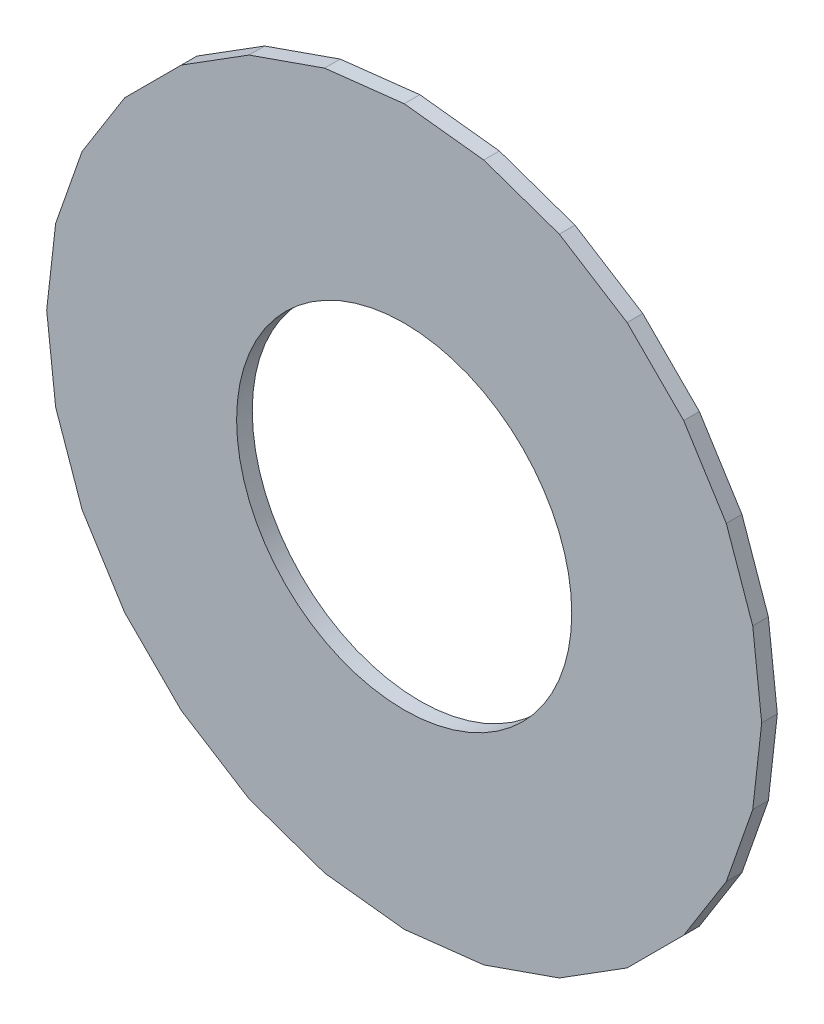
ISO-10303-21;
HEADER;
FILE_DESCRIPTION(('STEP AP214'),'2;1');
FILE_NAME('part.step','',(''),(''),'','','');
FILE_SCHEMA(('AUTOMOTIVE_DESIGN { 1 0 10303 214 1 1 1 1 }'));
ENDSEC;
DATA;
#1=APPLICATION_CONTEXT('core data for automotive mechanical design processes');
#2=APPLICATION_PROTOCOL_DEFINITION('international standard','automotive_design',2000,#1);
#3=PRODUCT_CONTEXT('',#1,'mechanical');
#4=PRODUCT('Part','Part','',(#3));
#5=PRODUCT_RELATED_PRODUCT_CATEGORY('part','',(#4));
#6=PRODUCT_DEFINITION_FORMATION('','',#4);
#7=PRODUCT_DEFINITION_CONTEXT('part definition',#1,'design');
#8=PRODUCT_DEFINITION('design','',#6,#7);
#9=PRODUCT_DEFINITION_SHAPE('','',#8);
#10=(LENGTH_UNIT() NAMED_UNIT(*) SI_UNIT(.MILLI.,.METRE.));
#11=(NAMED_UNIT(*) PLANE_ANGLE_UNIT() SI_UNIT($,.RADIAN.));
#12=(NAMED_UNIT(*) SI_UNIT($,.STERADIAN.) SOLID_ANGLE_UNIT());
#13=UNCERTAINTY_MEASURE_WITH_UNIT(LENGTH_MEASURE(1.E-05),#10,'distance_accuracy_value','');
#14=(GEOMETRIC_REPRESENTATION_CONTEXT(3) GLOBAL_UNCERTAINTY_ASSIGNED_CONTEXT((#13)) GLOBAL_UNIT_ASSIGNED_CONTEXT((#10,
#11,#12)) REPRESENTATION_CONTEXT('',''));
#15=CARTESIAN_POINT('',(0.,0.,0.));
#16=DIRECTION('',(0.,0.,1.));
#17=DIRECTION('',(1.,0.,0.));
#18=AXIS2_PLACEMENT_3D('',#15,#16,#17);
#19=CARTESIAN_POINT('',(165.608,-72.644,-0.045));
#20=DIRECTION('',(0.,0.,-1.));
#21=DIRECTION('',(0.,-1.,0.));
#22=AXIS2_PLACEMENT_3D('',#19,#20,#21);
#23=CYLINDRICAL_SURFACE('',#22,0.375);
#24=CARTESIAN_POINT('',(165.608,-72.644,1.67));
#25=DIRECTION('',(0.,0.,-1.));
#26=DIRECTION('',(0.,-1.,0.));
#27=AXIS2_PLACEMENT_3D('',#24,#25,#26);
#28=CIRCLE('',#27,0.375);
#29=CARTESIAN_POINT('',(165.608,-73.019,1.67));
#30=VERTEX_POINT('',#29);
#31=EDGE_CURVE('E553',#30,#30,#28,.T.);
#32=ORIENTED_EDGE('',*,*,#31,.T.);
#33=DIRECTION('',(0.,0.,1.));
#34=VECTOR('',#33,1.);
#35=CARTESIAN_POINT('',(165.608,-73.019,-0.045));
#36=LINE('',#35,#34);
#37=CARTESIAN_POINT('',(165.608,-73.019,1.705));
#38=VERTEX_POINT('',#37);
#39=EDGE_CURVE('E11',#30,#38,#36,.T.);
#40=ORIENTED_EDGE('',*,*,#39,.T.);
#41=CARTESIAN_POINT('',(165.608,-72.644,1.705));
#42=DIRECTION('',(0.,0.,-1.));
#43=DIRECTION('',(0.,-1.,0.));
#44=AXIS2_PLACEMENT_3D('',#41,#42,#43);
#45=CIRCLE('',#44,0.375);
#46=EDGE_CURVE('E333',#38,#38,#45,.T.);
#47=ORIENTED_EDGE('',*,*,#46,.F.);
#48=ORIENTED_EDGE('',*,*,#39,.F.);
#49=EDGE_LOOP('',(#32,#40,#47,#48));
#50=FACE_BOUND('',#49,.T.);
#51=ADVANCED_FACE('F17',(#50),#23,.F.);
#52=CARTESIAN_POINT('',(165.429983,-73.423942,1.67));
#53=DIRECTION('',(-0.330278315977918,-0.943883591336766,0.));
#54=DIRECTION('',(-0.943883591336766,0.330278315977918,0.));
#55=AXIS2_PLACEMENT_3D('',#52,#53,#54);
#56=PLANE('',#55);
#57=DIRECTION('',(0.,0.,1.));
#58=VECTOR('',#57,1.);
#59=CARTESIAN_POINT('',(165.429983,-73.423942,1.67));
#60=LINE('',#59,#58);
#61=CARTESIAN_POINT('',(165.429983,-73.423942,1.67));
#62=VERTEX_POINT('',#61);
#63=CARTESIAN_POINT('',(165.429983,-73.423942,1.705));
#64=VERTEX_POINT('',#63);
#65=EDGE_CURVE('E26',#62,#64,#60,.T.);
#66=ORIENTED_EDGE('',*,*,#65,.T.);
#67=DIRECTION('',(-0.943883591336766,0.330278315977918,0.));
#68=VECTOR('',#67,1.);
#69=CARTESIAN_POINT('',(165.429983,-73.423942,1.705));
#70=LINE('',#69,#68);
#71=CARTESIAN_POINT('',(165.260893,-73.364775,1.705));
#72=VERTEX_POINT('',#71);
#73=EDGE_CURVE('E296',#64,#72,#70,.T.);
#74=ORIENTED_EDGE('',*,*,#73,.T.);
#75=DIRECTION('',(0.,0.,1.));
#76=VECTOR('',#75,1.);
#77=CARTESIAN_POINT('',(165.260893,-73.364775,1.67));
#78=LINE('',#77,#76);
#79=CARTESIAN_POINT('',(165.260893,-73.364775,1.67));
#80=VERTEX_POINT('',#79);
#81=EDGE_CURVE('E317',#80,#72,#78,.T.);
#82=ORIENTED_EDGE('',*,*,#81,.F.);
#83=DIRECTION('',(-0.943883591336766,0.330278315977918,0.));
#84=VECTOR('',#83,1.);
#85=CARTESIAN_POINT('',(165.429983,-73.423942,1.67));
#86=LINE('',#85,#84);
#87=EDGE_CURVE('E480',#62,#80,#86,.T.);
#88=ORIENTED_EDGE('',*,*,#87,.F.);
#89=EDGE_LOOP('',(#66,#74,#82,#88));
#90=FACE_BOUND('',#89,.T.);
#91=ADVANCED_FACE('F617',(#90),#56,.T.);
#92=CARTESIAN_POINT('',(165.608,-73.444,1.67));
#93=DIRECTION('',(-0.111966136678988,-0.993712022789894,0.));
#94=DIRECTION('',(-0.993712022789894,0.111966136678988,0.));
#95=AXIS2_PLACEMENT_3D('',#92,#93,#94);
#96=PLANE('',#95);
#97=DIRECTION('',(0.,0.,1.));
#98=VECTOR('',#97,1.);
#99=CARTESIAN_POINT('',(165.608,-73.444,1.67));
#100=LINE('',#99,#98);
#101=CARTESIAN_POINT('',(165.608,-73.444,1.67));
#102=VERTEX_POINT('',#101);
#103=CARTESIAN_POINT('',(165.608,-73.444,1.705));
#104=VERTEX_POINT('',#103);
#105=EDGE_CURVE('E314',#102,#104,#100,.T.);
#106=ORIENTED_EDGE('',*,*,#105,.T.);
#107=DIRECTION('',(-0.993712022789894,0.111966136678988,0.));
#108=VECTOR('',#107,1.);
#109=CARTESIAN_POINT('',(165.608,-73.444,1.705));
#110=LINE('',#109,#108);
#111=EDGE_CURVE('E299',#104,#64,#110,.T.);
#112=ORIENTED_EDGE('',*,*,#111,.T.);
#113=ORIENTED_EDGE('',*,*,#65,.F.);
#114=DIRECTION('',(-0.993712022789894,0.111966136678988,0.));
#115=VECTOR('',#114,1.);
#116=CARTESIAN_POINT('',(165.608,-73.444,1.67));
#117=LINE('',#116,#115);
#118=EDGE_CURVE('E476',#102,#62,#117,.T.);
#119=ORIENTED_EDGE('',*,*,#118,.F.);
#120=EDGE_LOOP('',(#106,#112,#113,#119));
#121=FACE_BOUND('',#120,.T.);
#122=ADVANCED_FACE('F622',(#121),#96,.T.);
#123=CARTESIAN_POINT('',(165.260893,-73.364775,1.67));
#124=DIRECTION('',(-0.532032066600227,-0.846724205458361,0.));
#125=DIRECTION('',(-0.846724205458361,0.532032066600227,0.));
#126=AXIS2_PLACEMENT_3D('',#123,#124,#125);
#127=PLANE('',#126);
#128=ORIENTED_EDGE('',*,*,#81,.T.);
#129=DIRECTION('',(-0.846724205458361,0.532032066600227,0.));
#130=VECTOR('',#129,1.);
#131=CARTESIAN_POINT('',(165.260893,-73.364775,1.705));
#132=LINE('',#131,#130);
#133=CARTESIAN_POINT('',(165.109208,-73.269465,1.705));
#134=VERTEX_POINT('',#133);
#135=EDGE_CURVE('E295',#72,#134,#132,.T.);
#136=ORIENTED_EDGE('',*,*,#135,.T.);
#137=DIRECTION('',(0.,0.,1.));
#138=VECTOR('',#137,1.);
#139=CARTESIAN_POINT('',(165.109208,-73.269465,1.67));
#140=LINE('',#139,#138);
#141=CARTESIAN_POINT('',(165.109208,-73.269465,1.67));
#142=VERTEX_POINT('',#141);
#143=EDGE_CURVE('E318',#142,#134,#140,.T.);
#144=ORIENTED_EDGE('',*,*,#143,.F.);
#145=DIRECTION('',(-0.846724205458361,0.532032066600227,0.));
#146=VECTOR('',#145,1.);
#147=CARTESIAN_POINT('',(165.260893,-73.364775,1.67));
#148=LINE('',#147,#146);
#149=EDGE_CURVE('E512',#80,#142,#148,.T.);
#150=ORIENTED_EDGE('',*,*,#149,.F.);
#151=EDGE_LOOP('',(#128,#136,#144,#150));
#152=FACE_BOUND('',#151,.T.);
#153=ADVANCED_FACE('F394',(#152),#127,.T.);
#154=CARTESIAN_POINT('',(165.786017,-73.423942,1.67));
#155=DIRECTION('',(0.111966136678988,-0.993712022789894,0.));
#156=DIRECTION('',(0.,0.,-1.));
#157=AXIS2_PLACEMENT_3D('',#154,#155,#156);
#158=PLANE('',#157);
#159=DIRECTION('',(0.,0.,1.));
#160=VECTOR('',#159,1.);
#161=CARTESIAN_POINT('',(165.786017,-73.423942,1.67));
#162=LINE('',#161,#160);
#163=CARTESIAN_POINT('',(165.786017,-73.423942,1.67));
#164=VERTEX_POINT('',#163);
#165=CARTESIAN_POINT('',(165.786017,-73.423942,1.705));
#166=VERTEX_POINT('',#165);
#167=EDGE_CURVE('E379',#164,#166,#162,.T.);
#168=ORIENTED_EDGE('',*,*,#167,.T.);
#169=DIRECTION('',(-0.993712022789894,-0.111966136678988,0.));
#170=VECTOR('',#169,1.);
#171=CARTESIAN_POINT('',(165.786017,-73.423942,1.705));
#172=LINE('',#171,#170);
#173=EDGE_CURVE('E304',#166,#104,#172,.T.);
#174=ORIENTED_EDGE('',*,*,#173,.T.);
#175=ORIENTED_EDGE('',*,*,#105,.F.);
#176=DIRECTION('',(-0.993712022789894,-0.111966136678988,0.));
#177=VECTOR('',#176,1.);
#178=CARTESIAN_POINT('',(165.786017,-73.423942,1.67));
#179=LINE('',#178,#177);
#180=EDGE_CURVE('E481',#164,#102,#179,.T.);
#181=ORIENTED_EDGE('',*,*,#180,.F.);
#182=EDGE_LOOP('',(#168,#174,#175,#181));
#183=FACE_BOUND('',#182,.T.);
#184=ADVANCED_FACE('F678',(#183),#158,.T.);
#185=CARTESIAN_POINT('',(165.109208,-73.269465,1.67));
#186=DIRECTION('',(-0.707106781186548,-0.707106781186548,0.));
#187=DIRECTION('',(-0.707106781186548,0.707106781186548,0.));
#188=AXIS2_PLACEMENT_3D('',#185,#186,#187);
#189=PLANE('',#188);
#190=ORIENTED_EDGE('',*,*,#143,.T.);
#191=DIRECTION('',(-0.707106781186548,0.707106781186548,0.));
#192=VECTOR('',#191,1.);
#193=CARTESIAN_POINT('',(165.109208,-73.269465,1.705));
#194=LINE('',#193,#192);
#195=CARTESIAN_POINT('',(164.982535,-73.142792,1.705));
#196=VERTEX_POINT('',#195);
#197=EDGE_CURVE('E277',#134,#196,#194,.T.);
#198=ORIENTED_EDGE('',*,*,#197,.T.);
#199=DIRECTION('',(0.,0.,1.));
#200=VECTOR('',#199,1.);
#201=CARTESIAN_POINT('',(164.982535,-73.142792,1.67));
#202=LINE('',#201,#200);
#203=CARTESIAN_POINT('',(164.982535,-73.142792,1.67));
#204=VERTEX_POINT('',#203);
#205=EDGE_CURVE('E272',#204,#196,#202,.T.);
#206=ORIENTED_EDGE('',*,*,#205,.F.);
#207=DIRECTION('',(-0.707106781186548,0.707106781186548,0.));
#208=VECTOR('',#207,1.);
#209=CARTESIAN_POINT('',(165.109208,-73.269465,1.67));
#210=LINE('',#209,#208);
#211=EDGE_CURVE('E389',#142,#204,#210,.T.);
#212=ORIENTED_EDGE('',*,*,#211,.F.);
#213=EDGE_LOOP('',(#190,#198,#206,#212));
#214=FACE_BOUND('',#213,.T.);
#215=ADVANCED_FACE('F387',(#214),#189,.T.);
#216=CARTESIAN_POINT('',(165.955107,-73.364775,1.67));
#217=DIRECTION('',(0.330278315977027,-0.943883591337077,0.));
#218=DIRECTION('',(0.,0.,-1.));
#219=AXIS2_PLACEMENT_3D('',#216,#217,#218);
#220=PLANE('',#219);
#221=DIRECTION('',(0.,0.,1.));
#222=VECTOR('',#221,1.);
#223=CARTESIAN_POINT('',(165.955107,-73.364775,1.67));
#224=LINE('',#223,#222);
#225=CARTESIAN_POINT('',(165.955107,-73.364775,1.67));
#226=VERTEX_POINT('',#225);
#227=CARTESIAN_POINT('',(165.955107,-73.364775,1.705));
#228=VERTEX_POINT('',#227);
#229=EDGE_CURVE('E266',#226,#228,#224,.T.);
#230=ORIENTED_EDGE('',*,*,#229,.T.);
#231=DIRECTION('',(-0.943883591337077,-0.330278315977027,0.));
#232=VECTOR('',#231,1.);
#233=CARTESIAN_POINT('',(165.955107,-73.364775,1.705));
#234=LINE('',#233,#232);
#235=EDGE_CURVE('E313',#228,#166,#234,.T.);
#236=ORIENTED_EDGE('',*,*,#235,.T.);
#237=ORIENTED_EDGE('',*,*,#167,.F.);
#238=DIRECTION('',(-0.943883591337077,-0.330278315977027,0.));
#239=VECTOR('',#238,1.);
#240=CARTESIAN_POINT('',(165.955107,-73.364775,1.67));
#241=LINE('',#240,#239);
#242=EDGE_CURVE('E495',#226,#164,#241,.T.);
#243=ORIENTED_EDGE('',*,*,#242,.F.);
#244=EDGE_LOOP('',(#230,#236,#237,#243));
#245=FACE_BOUND('',#244,.T.);
#246=ADVANCED_FACE('F677',(#245),#220,.T.);
#247=CARTESIAN_POINT('',(164.982535,-73.142792,1.67));
#248=DIRECTION('',(-0.846724205458361,-0.532032066600227,0.));
#249=DIRECTION('',(-0.532032066600227,0.846724205458361,0.));
#250=AXIS2_PLACEMENT_3D('',#247,#248,#249);
#251=PLANE('',#250);
#252=ORIENTED_EDGE('',*,*,#205,.T.);
#253=DIRECTION('',(-0.532032066600227,0.846724205458361,0.));
#254=VECTOR('',#253,1.);
#255=CARTESIAN_POINT('',(164.982535,-73.142792,1.705));
#256=LINE('',#255,#254);
#257=CARTESIAN_POINT('',(164.887225,-72.991107,1.705));
#258=VERTEX_POINT('',#257);
#259=EDGE_CURVE('E270',#196,#258,#256,.T.);
#260=ORIENTED_EDGE('',*,*,#259,.T.);
#261=DIRECTION('',(0.,0.,1.));
#262=VECTOR('',#261,1.);
#263=CARTESIAN_POINT('',(164.887225,-72.991107,1.67));
#264=LINE('',#263,#262);
#265=CARTESIAN_POINT('',(164.887225,-72.991107,1.67));
#266=VERTEX_POINT('',#265);
#267=EDGE_CURVE('E254',#266,#258,#264,.T.);
#268=ORIENTED_EDGE('',*,*,#267,.F.);
#269=DIRECTION('',(-0.532032066600227,0.846724205458361,0.));
#270=VECTOR('',#269,1.);
#271=CARTESIAN_POINT('',(164.982535,-73.142792,1.67));
#272=LINE('',#271,#270);
#273=EDGE_CURVE('E527',#204,#266,#272,.T.);
#274=ORIENTED_EDGE('',*,*,#273,.F.);
#275=EDGE_LOOP('',(#252,#260,#268,#274));
#276=FACE_BOUND('',#275,.T.);
#277=ADVANCED_FACE('F271',(#276),#251,.T.);
#278=CARTESIAN_POINT('',(166.106792,-73.269465,1.67));
#279=DIRECTION('',(0.532032066600227,-0.846724205458361,0.));
#280=DIRECTION('',(0.,0.,-1.));
#281=AXIS2_PLACEMENT_3D('',#278,#279,#280);
#282=PLANE('',#281);
#283=DIRECTION('',(0.,0.,1.));
#284=VECTOR('',#283,1.);
#285=CARTESIAN_POINT('',(166.106792,-73.269465,1.67));
#286=LINE('',#285,#284);
#287=CARTESIAN_POINT('',(166.106792,-73.269465,1.67));
#288=VERTEX_POINT('',#287);
#289=CARTESIAN_POINT('',(166.106792,-73.269465,1.705));
#290=VERTEX_POINT('',#289);
#291=EDGE_CURVE('E267',#288,#290,#286,.T.);
#292=ORIENTED_EDGE('',*,*,#291,.T.);
#293=DIRECTION('',(-0.846724205458361,-0.532032066600227,0.));
#294=VECTOR('',#293,1.);
#295=CARTESIAN_POINT('',(166.106792,-73.269465,1.705));
#296=LINE('',#295,#294);
#297=EDGE_CURVE('E322',#290,#228,#296,.T.);
#298=ORIENTED_EDGE('',*,*,#297,.T.);
#299=ORIENTED_EDGE('',*,*,#229,.F.);
#300=DIRECTION('',(-0.846724205458361,-0.532032066600227,0.));
#301=VECTOR('',#300,1.);
#302=CARTESIAN_POINT('',(166.106792,-73.269465,1.67));
#303=LINE('',#302,#301);
#304=EDGE_CURVE('E499',#288,#226,#303,.T.);
#305=ORIENTED_EDGE('',*,*,#304,.F.);
#306=EDGE_LOOP('',(#292,#298,#299,#305));
#307=FACE_BOUND('',#306,.T.);
#308=ADVANCED_FACE('F749',(#307),#282,.T.);
#309=CARTESIAN_POINT('',(164.887225,-72.991107,1.67));
#310=DIRECTION('',(-0.943883591337077,-0.330278315977027,0.));
#311=DIRECTION('',(-0.330278315977027,0.943883591337077,0.));
#312=AXIS2_PLACEMENT_3D('',#309,#310,#311);
#313=PLANE('',#312);
#314=ORIENTED_EDGE('',*,*,#267,.T.);
#315=DIRECTION('',(-0.330278315977027,0.943883591337077,0.));
#316=VECTOR('',#315,1.);
#317=CARTESIAN_POINT('',(164.887225,-72.991107,1.705));
#318=LINE('',#317,#316);
#319=CARTESIAN_POINT('',(164.828058,-72.822017,1.705));
#320=VERTEX_POINT('',#319);
#321=EDGE_CURVE('E258',#258,#320,#318,.T.);
#322=ORIENTED_EDGE('',*,*,#321,.T.);
#323=DIRECTION('',(0.,0.,1.));
#324=VECTOR('',#323,1.);
#325=CARTESIAN_POINT('',(164.828058,-72.822017,1.67));
#326=LINE('',#325,#324);
#327=CARTESIAN_POINT('',(164.828058,-72.822017,1.67));
#328=VERTEX_POINT('',#327);
#329=EDGE_CURVE('E248',#328,#320,#326,.T.);
#330=ORIENTED_EDGE('',*,*,#329,.F.);
#331=DIRECTION('',(-0.330278315977027,0.943883591337077,0.));
#332=VECTOR('',#331,1.);
#333=CARTESIAN_POINT('',(164.887225,-72.991107,1.67));
#334=LINE('',#333,#332);
#335=EDGE_CURVE('E261',#266,#328,#334,.T.);
#336=ORIENTED_EDGE('',*,*,#335,.F.);
#337=EDGE_LOOP('',(#314,#322,#330,#336));
#338=FACE_BOUND('',#337,.T.);
#339=ADVANCED_FACE('F256',(#338),#313,.T.);
#340=CARTESIAN_POINT('',(166.233465,-73.142792,1.67));
#341=DIRECTION('',(0.707106781186548,-0.707106781186548,0.));
#342=DIRECTION('',(0.,0.,-1.));
#343=AXIS2_PLACEMENT_3D('',#340,#341,#342);
#344=PLANE('',#343);
#345=DIRECTION('',(0.,0.,1.));
#346=VECTOR('',#345,1.);
#347=CARTESIAN_POINT('',(166.233465,-73.142792,1.67));
#348=LINE('',#347,#346);
#349=CARTESIAN_POINT('',(166.233465,-73.142792,1.67));
#350=VERTEX_POINT('',#349);
#351=CARTESIAN_POINT('',(166.233465,-73.142792,1.705));
#352=VERTEX_POINT('',#351);
#353=EDGE_CURVE('E513',#350,#352,#348,.T.);
#354=ORIENTED_EDGE('',*,*,#353,.T.);
#355=DIRECTION('',(-0.707106781186548,-0.707106781186548,0.));
#356=VECTOR('',#355,1.);
#357=CARTESIAN_POINT('',(166.233465,-73.142792,1.705));
#358=LINE('',#357,#356);
#359=EDGE_CURVE('E328',#352,#290,#358,.T.);
#360=ORIENTED_EDGE('',*,*,#359,.T.);
#361=ORIENTED_EDGE('',*,*,#291,.F.);
#362=DIRECTION('',(-0.707106781186548,-0.707106781186548,0.));
#363=VECTOR('',#362,1.);
#364=CARTESIAN_POINT('',(166.233465,-73.142792,1.67));
#365=LINE('',#364,#363);
#366=EDGE_CURVE('E494',#350,#288,#365,.T.);
#367=ORIENTED_EDGE('',*,*,#366,.F.);
#368=EDGE_LOOP('',(#354,#360,#361,#367));
#369=FACE_BOUND('',#368,.T.);
#370=ADVANCED_FACE('F603',(#369),#344,.T.);
#371=CARTESIAN_POINT('',(164.828058,-72.822017,1.67));
#372=DIRECTION('',(-0.993712022789894,-0.111966136678988,0.));
#373=DIRECTION('',(-0.111966136678988,0.993712022789894,0.));
#374=AXIS2_PLACEMENT_3D('',#371,#372,#373);
#375=PLANE('',#374);
#376=ORIENTED_EDGE('',*,*,#329,.T.);
#377=DIRECTION('',(-0.111966136678988,0.993712022789894,0.));
#378=VECTOR('',#377,1.);
#379=CARTESIAN_POINT('',(164.828058,-72.822017,1.705));
#380=LINE('',#379,#378);
#381=CARTESIAN_POINT('',(164.808,-72.644,1.705));
#382=VERTEX_POINT('',#381);
#383=EDGE_CURVE('E282',#320,#382,#380,.T.);
#384=ORIENTED_EDGE('',*,*,#383,.T.);
#385=DIRECTION('',(0.,0.,1.));
#386=VECTOR('',#385,1.);
#387=CARTESIAN_POINT('',(164.808,-72.644,1.67));
#388=LINE('',#387,#386);
#389=CARTESIAN_POINT('',(164.808,-72.644,1.67));
#390=VERTEX_POINT('',#389);
#391=EDGE_CURVE('E374',#390,#382,#388,.T.);
#392=ORIENTED_EDGE('',*,*,#391,.F.);
#393=DIRECTION('',(-0.111966136678988,0.993712022789894,0.));
#394=VECTOR('',#393,1.);
#395=CARTESIAN_POINT('',(164.828058,-72.822017,1.67));
#396=LINE('',#395,#394);
#397=EDGE_CURVE('E448',#328,#390,#396,.T.);
#398=ORIENTED_EDGE('',*,*,#397,.F.);
#399=EDGE_LOOP('',(#376,#384,#392,#398));
#400=FACE_BOUND('',#399,.T.);
#401=ADVANCED_FACE('F600',(#400),#375,.T.);
#402=CARTESIAN_POINT('',(166.328775,-72.991107,1.67));
#403=DIRECTION('',(0.846724205458361,-0.532032066600227,0.));
#404=DIRECTION('',(0.,0.,-1.));
#405=AXIS2_PLACEMENT_3D('',#402,#403,#404);
#406=PLANE('',#405);
#407=DIRECTION('',(0.,0.,1.));
#408=VECTOR('',#407,1.);
#409=CARTESIAN_POINT('',(166.328775,-72.991107,1.67));
#410=LINE('',#409,#408);
#411=CARTESIAN_POINT('',(166.328775,-72.991107,1.67));
#412=VERTEX_POINT('',#411);
#413=CARTESIAN_POINT('',(166.328775,-72.991107,1.705));
#414=VERTEX_POINT('',#413);
#415=EDGE_CURVE('E371',#412,#414,#410,.T.);
#416=ORIENTED_EDGE('',*,*,#415,.T.);
#417=DIRECTION('',(-0.532032066600227,-0.846724205458361,0.));
#418=VECTOR('',#417,1.);
#419=CARTESIAN_POINT('',(166.328775,-72.991107,1.705));
#420=LINE('',#419,#418);
#421=EDGE_CURVE('E332',#414,#352,#420,.T.);
#422=ORIENTED_EDGE('',*,*,#421,.T.);
#423=ORIENTED_EDGE('',*,*,#353,.F.);
#424=DIRECTION('',(-0.532032066600227,-0.846724205458361,0.));
#425=VECTOR('',#424,1.);
#426=CARTESIAN_POINT('',(166.328775,-72.991107,1.67));
#427=LINE('',#426,#425);
#428=EDGE_CURVE('E462',#412,#350,#427,.T.);
#429=ORIENTED_EDGE('',*,*,#428,.F.);
#430=EDGE_LOOP('',(#416,#422,#423,#429));
#431=FACE_BOUND('',#430,.T.);
#432=ADVANCED_FACE('F602',(#431),#406,.T.);
#433=CARTESIAN_POINT('',(164.808,-72.644,1.67));
#434=DIRECTION('',(-0.993712022789894,0.111966136678988,0.));
#435=DIRECTION('',(0.,0.,1.));
#436=AXIS2_PLACEMENT_3D('',#433,#434,#435);
#437=PLANE('',#436);
#438=ORIENTED_EDGE('',*,*,#391,.T.);
#439=DIRECTION('',(0.111966136678988,0.993712022789894,0.));
#440=VECTOR('',#439,1.);
#441=CARTESIAN_POINT('',(164.808,-72.644,1.705));
#442=LINE('',#441,#440);
#443=CARTESIAN_POINT('',(164.828058,-72.465983,1.705));
#444=VERTEX_POINT('',#443);
#445=EDGE_CURVE('E289',#382,#444,#442,.T.);
#446=ORIENTED_EDGE('',*,*,#445,.T.);
#447=DIRECTION('',(0.,0.,1.));
#448=VECTOR('',#447,1.);
#449=CARTESIAN_POINT('',(164.828058,-72.465983,1.67));
#450=LINE('',#449,#448);
#451=CARTESIAN_POINT('',(164.828058,-72.465983,1.67));
#452=VERTEX_POINT('',#451);
#453=EDGE_CURVE('E368',#452,#444,#450,.T.);
#454=ORIENTED_EDGE('',*,*,#453,.F.);
#455=DIRECTION('',(0.111966136678988,0.993712022789894,0.));
#456=VECTOR('',#455,1.);
#457=CARTESIAN_POINT('',(164.808,-72.644,1.67));
#458=LINE('',#457,#456);
#459=EDGE_CURVE('E452',#390,#452,#458,.T.);
#460=ORIENTED_EDGE('',*,*,#459,.F.);
#461=EDGE_LOOP('',(#438,#446,#454,#460));
#462=FACE_BOUND('',#461,.T.);
#463=ADVANCED_FACE('F590',(#462),#437,.T.);
#464=CARTESIAN_POINT('',(166.387942,-72.822017,1.67));
#465=DIRECTION('',(0.943883591337077,-0.330278315977027,0.));
#466=DIRECTION('',(0.,0.,-1.));
#467=AXIS2_PLACEMENT_3D('',#464,#465,#466);
#468=PLANE('',#467);
#469=DIRECTION('',(0.,0.,1.));
#470=VECTOR('',#469,1.);
#471=CARTESIAN_POINT('',(166.387942,-72.822017,1.67));
#472=LINE('',#471,#470);
#473=CARTESIAN_POINT('',(166.387942,-72.822017,1.67));
#474=VERTEX_POINT('',#473);
#475=CARTESIAN_POINT('',(166.387942,-72.822017,1.705));
#476=VERTEX_POINT('',#475);
#477=EDGE_CURVE('E367',#474,#476,#472,.T.);
#478=ORIENTED_EDGE('',*,*,#477,.T.);
#479=DIRECTION('',(-0.330278315977027,-0.943883591337077,0.));
#480=VECTOR('',#479,1.);
#481=CARTESIAN_POINT('',(166.387942,-72.822017,1.705));
#482=LINE('',#481,#480);
#483=EDGE_CURVE('E341',#476,#414,#482,.T.);
#484=ORIENTED_EDGE('',*,*,#483,.T.);
#485=ORIENTED_EDGE('',*,*,#415,.F.);
#486=DIRECTION('',(-0.330278315977027,-0.943883591337077,0.));
#487=VECTOR('',#486,1.);
#488=CARTESIAN_POINT('',(166.387942,-72.822017,1.67));
#489=LINE('',#488,#487);
#490=EDGE_CURVE('E458',#474,#412,#489,.T.);
#491=ORIENTED_EDGE('',*,*,#490,.F.);
#492=EDGE_LOOP('',(#478,#484,#485,#491));
#493=FACE_BOUND('',#492,.T.);
#494=ADVANCED_FACE('F645',(#493),#468,.T.);
#495=CARTESIAN_POINT('',(164.828058,-72.465983,1.67));
#496=DIRECTION('',(-0.943883591337077,0.330278315977027,0.));
#497=DIRECTION('',(0.,0.,1.));
#498=AXIS2_PLACEMENT_3D('',#495,#496,#497);
#499=PLANE('',#498);
#500=ORIENTED_EDGE('',*,*,#453,.T.);
#501=DIRECTION('',(0.330278315977027,0.943883591337077,0.));
#502=VECTOR('',#501,1.);
#503=CARTESIAN_POINT('',(164.828058,-72.465983,1.705));
#504=LINE('',#503,#502);
#505=CARTESIAN_POINT('',(164.887225,-72.296893,1.705));
#506=VERTEX_POINT('',#505);
#507=EDGE_CURVE('E581',#444,#506,#504,.T.);
#508=ORIENTED_EDGE('',*,*,#507,.T.);
#509=DIRECTION('',(0.,0.,1.));
#510=VECTOR('',#509,1.);
#511=CARTESIAN_POINT('',(164.887225,-72.296893,1.67));
#512=LINE('',#511,#510);
#513=CARTESIAN_POINT('',(164.887225,-72.296893,1.67));
#514=VERTEX_POINT('',#513);
#515=EDGE_CURVE('E326',#514,#506,#512,.T.);
#516=ORIENTED_EDGE('',*,*,#515,.F.);
#517=DIRECTION('',(0.330278315977027,0.943883591337077,0.));
#518=VECTOR('',#517,1.);
#519=CARTESIAN_POINT('',(164.828058,-72.465983,1.67));
#520=LINE('',#519,#518);
#521=EDGE_CURVE('E408',#452,#514,#520,.T.);
#522=ORIENTED_EDGE('',*,*,#521,.F.);
#523=EDGE_LOOP('',(#500,#508,#516,#522));
#524=FACE_BOUND('',#523,.T.);
#525=ADVANCED_FACE('F596',(#524),#499,.T.);
#526=CARTESIAN_POINT('',(166.408,-72.644,1.67));
#527=DIRECTION('',(0.993712022789894,-0.111966136678988,0.));
#528=DIRECTION('',(0.,0.,-1.));
#529=AXIS2_PLACEMENT_3D('',#526,#527,#528);
#530=PLANE('',#529);
#531=DIRECTION('',(0.,0.,1.));
#532=VECTOR('',#531,1.);
#533=CARTESIAN_POINT('',(166.408,-72.644,1.67));
#534=LINE('',#533,#532);
#535=CARTESIAN_POINT('',(166.408,-72.644,1.67));
#536=VERTEX_POINT('',#535);
#537=CARTESIAN_POINT('',(166.408,-72.644,1.705));
#538=VERTEX_POINT('',#537);
#539=EDGE_CURVE('E323',#536,#538,#534,.T.);
#540=ORIENTED_EDGE('',*,*,#539,.T.);
#541=DIRECTION('',(-0.111966136678988,-0.993712022789894,0.));
#542=VECTOR('',#541,1.);
#543=CARTESIAN_POINT('',(166.408,-72.644,1.705));
#544=LINE('',#543,#542);
#545=EDGE_CURVE('E309',#538,#476,#544,.T.);
#546=ORIENTED_EDGE('',*,*,#545,.T.);
#547=ORIENTED_EDGE('',*,*,#477,.F.);
#548=DIRECTION('',(-0.111966136678988,-0.993712022789894,0.));
#549=VECTOR('',#548,1.);
#550=CARTESIAN_POINT('',(166.408,-72.644,1.67));
#551=LINE('',#550,#549);
#552=EDGE_CURVE('E463',#536,#474,#551,.T.);
#553=ORIENTED_EDGE('',*,*,#552,.F.);
#554=EDGE_LOOP('',(#540,#546,#547,#553));
#555=FACE_BOUND('',#554,.T.);
#556=ADVANCED_FACE('F684',(#555),#530,.T.);
#557=CARTESIAN_POINT('',(164.887225,-72.296893,1.67));
#558=DIRECTION('',(-0.846724205458361,0.532032066600227,0.));
#559=DIRECTION('',(0.,0.,1.));
#560=AXIS2_PLACEMENT_3D('',#557,#558,#559);
#561=PLANE('',#560);
#562=ORIENTED_EDGE('',*,*,#515,.T.);
#563=DIRECTION('',(0.532032066600227,0.846724205458361,0.));
#564=VECTOR('',#563,1.);
#565=CARTESIAN_POINT('',(164.887225,-72.296893,1.705));
#566=LINE('',#565,#564);
#567=CARTESIAN_POINT('',(164.982535,-72.145208,1.705));
#568=VERTEX_POINT('',#567);
#569=EDGE_CURVE('E577',#506,#568,#566,.T.);
#570=ORIENTED_EDGE('',*,*,#569,.T.);
#571=DIRECTION('',(0.,0.,1.));
#572=VECTOR('',#571,1.);
#573=CARTESIAN_POINT('',(164.982535,-72.145208,1.67));
#574=LINE('',#573,#572);
#575=CARTESIAN_POINT('',(164.982535,-72.145208,1.67));
#576=VERTEX_POINT('',#575);
#577=EDGE_CURVE('E327',#576,#568,#574,.T.);
#578=ORIENTED_EDGE('',*,*,#577,.F.);
#579=DIRECTION('',(0.532032066600227,0.846724205458361,0.));
#580=VECTOR('',#579,1.);
#581=CARTESIAN_POINT('',(164.887225,-72.296893,1.67));
#582=LINE('',#581,#580);
#583=EDGE_CURVE('E403',#514,#576,#582,.T.);
#584=ORIENTED_EDGE('',*,*,#583,.F.);
#585=EDGE_LOOP('',(#562,#570,#578,#584));
#586=FACE_BOUND('',#585,.T.);
#587=ADVANCED_FACE('F687',(#586),#561,.T.);
#588=CARTESIAN_POINT('',(166.387942,-72.465983,1.67));
#589=DIRECTION('',(0.993712022789894,0.111966136678988,0.));
#590=DIRECTION('',(0.,0.,-1.));
#591=AXIS2_PLACEMENT_3D('',#588,#589,#590);
#592=PLANE('',#591);
#593=DIRECTION('',(0.,0.,1.));
#594=VECTOR('',#593,1.);
#595=CARTESIAN_POINT('',(166.387942,-72.465983,1.67));
#596=LINE('',#595,#594);
#597=CARTESIAN_POINT('',(166.387942,-72.465983,1.67));
#598=VERTEX_POINT('',#597);
#599=CARTESIAN_POINT('',(166.387942,-72.465983,1.705));
#600=VERTEX_POINT('',#599);
#601=EDGE_CURVE('E111',#598,#600,#596,.T.);
#602=ORIENTED_EDGE('',*,*,#601,.T.);
#603=DIRECTION('',(0.111966136678988,-0.993712022789894,0.));
#604=VECTOR('',#603,1.);
#605=CARTESIAN_POINT('',(166.387942,-72.465983,1.705));
#606=LINE('',#605,#604);
#607=EDGE_CURVE('E305',#600,#538,#606,.T.);
#608=ORIENTED_EDGE('',*,*,#607,.T.);
#609=ORIENTED_EDGE('',*,*,#539,.F.);
#610=DIRECTION('',(0.111966136678988,-0.993712022789894,0.));
#611=VECTOR('',#610,1.);
#612=CARTESIAN_POINT('',(166.387942,-72.465983,1.67));
#613=LINE('',#612,#611);
#614=EDGE_CURVE('E424',#598,#536,#613,.T.);
#615=ORIENTED_EDGE('',*,*,#614,.F.);
#616=EDGE_LOOP('',(#602,#608,#609,#615));
#617=FACE_BOUND('',#616,.T.);
#618=ADVANCED_FACE('F654',(#617),#592,.T.);
#619=CARTESIAN_POINT('',(164.982535,-72.145208,1.67));
#620=DIRECTION('',(-0.707106781186548,0.707106781186548,0.));
#621=DIRECTION('',(0.,0.,1.));
#622=AXIS2_PLACEMENT_3D('',#619,#620,#621);
#623=PLANE('',#622);
#624=ORIENTED_EDGE('',*,*,#577,.T.);
#625=DIRECTION('',(0.707106781186548,0.707106781186548,0.));
#626=VECTOR('',#625,1.);
#627=CARTESIAN_POINT('',(164.982535,-72.145208,1.705));
#628=LINE('',#627,#626);
#629=CARTESIAN_POINT('',(165.109208,-72.018535,1.705));
#630=VERTEX_POINT('',#629);
#631=EDGE_CURVE('E570',#568,#630,#628,.T.);
#632=ORIENTED_EDGE('',*,*,#631,.T.);
#633=DIRECTION('',(0.,0.,1.));
#634=VECTOR('',#633,1.);
#635=CARTESIAN_POINT('',(165.109208,-72.018535,1.67));
#636=LINE('',#635,#634);
#637=CARTESIAN_POINT('',(165.109208,-72.018535,1.67));
#638=VERTEX_POINT('',#637);
#639=EDGE_CURVE('E356',#638,#630,#636,.T.);
#640=ORIENTED_EDGE('',*,*,#639,.F.);
#641=DIRECTION('',(0.707106781186548,0.707106781186548,0.));
#642=VECTOR('',#641,1.);
#643=CARTESIAN_POINT('',(164.982535,-72.145208,1.67));
#644=LINE('',#643,#642);
#645=EDGE_CURVE('E407',#576,#638,#644,.T.);
#646=ORIENTED_EDGE('',*,*,#645,.F.);
#647=EDGE_LOOP('',(#624,#632,#640,#646));
#648=FACE_BOUND('',#647,.T.);
#649=ADVANCED_FACE('F650',(#648),#623,.T.);
#650=CARTESIAN_POINT('',(166.328775,-72.296893,1.67));
#651=DIRECTION('',(0.943883591337077,0.330278315977027,0.));
#652=DIRECTION('',(0.,0.,-1.));
#653=AXIS2_PLACEMENT_3D('',#650,#651,#652);
#654=PLANE('',#653);
#655=DIRECTION('',(0.,0.,1.));
#656=VECTOR('',#655,1.);
#657=CARTESIAN_POINT('',(166.328775,-72.296893,1.67));
#658=LINE('',#657,#656);
#659=CARTESIAN_POINT('',(166.328775,-72.296893,1.67));
#660=VERTEX_POINT('',#659);
#661=CARTESIAN_POINT('',(166.328775,-72.296893,1.705));
#662=VERTEX_POINT('',#661);
#663=EDGE_CURVE('E99',#660,#662,#658,.T.);
#664=ORIENTED_EDGE('',*,*,#663,.T.);
#665=DIRECTION('',(0.330278315977027,-0.943883591337077,0.));
#666=VECTOR('',#665,1.);
#667=CARTESIAN_POINT('',(166.328775,-72.296893,1.705));
#668=LINE('',#667,#666);
#669=EDGE_CURVE('E308',#662,#600,#668,.T.);
#670=ORIENTED_EDGE('',*,*,#669,.T.);
#671=ORIENTED_EDGE('',*,*,#601,.F.);
#672=DIRECTION('',(0.330278315977027,-0.943883591337077,0.));
#673=VECTOR('',#672,1.);
#674=CARTESIAN_POINT('',(166.328775,-72.296893,1.67));
#675=LINE('',#674,#673);
#676=EDGE_CURVE('E420',#660,#598,#675,.T.);
#677=ORIENTED_EDGE('',*,*,#676,.F.);
#678=EDGE_LOOP('',(#664,#670,#671,#677));
#679=FACE_BOUND('',#678,.T.);
#680=ADVANCED_FACE('F653',(#679),#654,.T.);
#681=CARTESIAN_POINT('',(165.109208,-72.018535,1.67));
#682=DIRECTION('',(-0.532032066600227,0.846724205458361,0.));
#683=DIRECTION('',(0.,0.,1.));
#684=AXIS2_PLACEMENT_3D('',#681,#682,#683);
#685=PLANE('',#684);
#686=ORIENTED_EDGE('',*,*,#639,.T.);
#687=DIRECTION('',(0.846724205458361,0.532032066600227,0.));
#688=VECTOR('',#687,1.);
#689=CARTESIAN_POINT('',(165.109208,-72.018535,1.705));
#690=LINE('',#689,#688);
#691=CARTESIAN_POINT('',(165.260893,-71.923225,1.705));
#692=VERTEX_POINT('',#691);
#693=EDGE_CURVE('E566',#630,#692,#690,.T.);
#694=ORIENTED_EDGE('',*,*,#693,.T.);
#695=DIRECTION('',(0.,0.,1.));
#696=VECTOR('',#695,1.);
#697=CARTESIAN_POINT('',(165.260893,-71.923225,1.67));
#698=LINE('',#697,#696);
#699=CARTESIAN_POINT('',(165.260893,-71.923225,1.67));
#700=VERTEX_POINT('',#699);
#701=EDGE_CURVE('E351',#700,#692,#698,.T.);
#702=ORIENTED_EDGE('',*,*,#701,.F.);
#703=DIRECTION('',(0.846724205458361,0.532032066600227,0.));
#704=VECTOR('',#703,1.);
#705=CARTESIAN_POINT('',(165.109208,-72.018535,1.67));
#706=LINE('',#705,#704);
#707=EDGE_CURVE('E524',#638,#700,#706,.T.);
#708=ORIENTED_EDGE('',*,*,#707,.F.);
#709=EDGE_LOOP('',(#686,#694,#702,#708));
#710=FACE_BOUND('',#709,.T.);
#711=ADVANCED_FACE('F667',(#710),#685,.T.);
#712=CARTESIAN_POINT('',(166.233465,-72.145208,1.67));
#713=DIRECTION('',(0.846724205458361,0.532032066600227,0.));
#714=DIRECTION('',(0.,0.,-1.));
#715=AXIS2_PLACEMENT_3D('',#712,#713,#714);
#716=PLANE('',#715);
#717=DIRECTION('',(0.,0.,1.));
#718=VECTOR('',#717,1.);
#719=CARTESIAN_POINT('',(166.233465,-72.145208,1.67));
#720=LINE('',#719,#718);
#721=CARTESIAN_POINT('',(166.233465,-72.145208,1.67));
#722=VERTEX_POINT('',#721);
#723=CARTESIAN_POINT('',(166.233465,-72.145208,1.705));
#724=VERTEX_POINT('',#723);
#725=EDGE_CURVE('E350',#722,#724,#720,.T.);
#726=ORIENTED_EDGE('',*,*,#725,.T.);
#727=DIRECTION('',(0.532032066600227,-0.846724205458361,0.));
#728=VECTOR('',#727,1.);
#729=CARTESIAN_POINT('',(166.233465,-72.145208,1.705));
#730=LINE('',#729,#728);
#731=EDGE_CURVE('E342',#724,#662,#730,.T.);
#732=ORIENTED_EDGE('',*,*,#731,.T.);
#733=ORIENTED_EDGE('',*,*,#663,.F.);
#734=DIRECTION('',(0.532032066600227,-0.846724205458361,0.));
#735=VECTOR('',#734,1.);
#736=CARTESIAN_POINT('',(166.233465,-72.145208,1.67));
#737=LINE('',#736,#735);
#738=EDGE_CURVE('E425',#722,#660,#737,.T.);
#739=ORIENTED_EDGE('',*,*,#738,.F.);
#740=EDGE_LOOP('',(#726,#732,#733,#739));
#741=FACE_BOUND('',#740,.T.);
#742=ADVANCED_FACE('F670',(#741),#716,.T.);
#743=CARTESIAN_POINT('',(165.260893,-71.923225,1.67));
#744=DIRECTION('',(-0.330278315977918,0.943883591336766,0.));
#745=DIRECTION('',(0.,0.,1.));
#746=AXIS2_PLACEMENT_3D('',#743,#744,#745);
#747=PLANE('',#746);
#748=ORIENTED_EDGE('',*,*,#701,.T.);
#749=DIRECTION('',(0.943883591336766,0.330278315977918,0.));
#750=VECTOR('',#749,1.);
#751=CARTESIAN_POINT('',(165.260893,-71.923225,1.705));
#752=LINE('',#751,#750);
#753=CARTESIAN_POINT('',(165.429983,-71.864058,1.705));
#754=VERTEX_POINT('',#753);
#755=EDGE_CURVE('E562',#692,#754,#752,.T.);
#756=ORIENTED_EDGE('',*,*,#755,.T.);
#757=DIRECTION('',(0.,0.,1.));
#758=VECTOR('',#757,1.);
#759=CARTESIAN_POINT('',(165.429983,-71.864058,1.67));
#760=LINE('',#759,#758);
#761=CARTESIAN_POINT('',(165.429983,-71.864058,1.67));
#762=VERTEX_POINT('',#761);
#763=EDGE_CURVE('E336',#762,#754,#760,.T.);
#764=ORIENTED_EDGE('',*,*,#763,.F.);
#765=DIRECTION('',(0.943883591336766,0.330278315977918,0.));
#766=VECTOR('',#765,1.);
#767=CARTESIAN_POINT('',(165.260893,-71.923225,1.67));
#768=LINE('',#767,#766);
#769=EDGE_CURVE('E519',#700,#762,#768,.T.);
#770=ORIENTED_EDGE('',*,*,#769,.F.);
#771=EDGE_LOOP('',(#748,#756,#764,#770));
#772=FACE_BOUND('',#771,.T.);
#773=ADVANCED_FACE('F665',(#772),#747,.T.);
#774=CARTESIAN_POINT('',(166.106792,-72.018535,1.67));
#775=DIRECTION('',(0.707106781186548,0.707106781186548,0.));
#776=DIRECTION('',(0.,0.,-1.));
#777=AXIS2_PLACEMENT_3D('',#774,#775,#776);
#778=PLANE('',#777);
#779=DIRECTION('',(0.,0.,1.));
#780=VECTOR('',#779,1.);
#781=CARTESIAN_POINT('',(166.106792,-72.018535,1.67));
#782=LINE('',#781,#780);
#783=CARTESIAN_POINT('',(166.106792,-72.018535,1.67));
#784=VERTEX_POINT('',#783);
#785=CARTESIAN_POINT('',(166.106792,-72.018535,1.705));
#786=VERTEX_POINT('',#785);
#787=EDGE_CURVE('E467',#784,#786,#782,.T.);
#788=ORIENTED_EDGE('',*,*,#787,.T.);
#789=DIRECTION('',(0.707106781186548,-0.707106781186548,0.));
#790=VECTOR('',#789,1.);
#791=CARTESIAN_POINT('',(166.106792,-72.018535,1.705));
#792=LINE('',#791,#790);
#793=EDGE_CURVE('E337',#786,#724,#792,.T.);
#794=ORIENTED_EDGE('',*,*,#793,.T.);
#795=ORIENTED_EDGE('',*,*,#725,.F.);
#796=DIRECTION('',(0.707106781186548,-0.707106781186548,0.));
#797=VECTOR('',#796,1.);
#798=CARTESIAN_POINT('',(166.106792,-72.018535,1.67));
#799=LINE('',#798,#797);
#800=EDGE_CURVE('E475',#784,#722,#799,.T.);
#801=ORIENTED_EDGE('',*,*,#800,.F.);
#802=EDGE_LOOP('',(#788,#794,#795,#801));
#803=FACE_BOUND('',#802,.T.);
#804=ADVANCED_FACE('F660',(#803),#778,.T.);
#805=CARTESIAN_POINT('',(165.429983,-71.864058,1.67));
#806=DIRECTION('',(-0.111966136678988,0.993712022789894,0.));
#807=DIRECTION('',(0.,0.,1.));
#808=AXIS2_PLACEMENT_3D('',#805,#806,#807);
#809=PLANE('',#808);
#810=ORIENTED_EDGE('',*,*,#763,.T.);
#811=DIRECTION('',(0.993712022789894,0.111966136678988,0.));
#812=VECTOR('',#811,1.);
#813=CARTESIAN_POINT('',(165.429983,-71.864058,1.705));
#814=LINE('',#813,#812);
#815=CARTESIAN_POINT('',(165.608,-71.844,1.705));
#816=VERTEX_POINT('',#815);
#817=EDGE_CURVE('E556',#754,#816,#814,.T.);
#818=ORIENTED_EDGE('',*,*,#817,.T.);
#819=DIRECTION('',(0.,0.,1.));
#820=VECTOR('',#819,1.);
#821=CARTESIAN_POINT('',(165.608,-71.844,1.67));
#822=LINE('',#821,#820);
#823=CARTESIAN_POINT('',(165.608,-71.844,1.67));
#824=VERTEX_POINT('',#823);
#825=EDGE_CURVE('E444',#824,#816,#822,.T.);
#826=ORIENTED_EDGE('',*,*,#825,.F.);
#827=DIRECTION('',(0.993712022789894,0.111966136678988,0.));
#828=VECTOR('',#827,1.);
#829=CARTESIAN_POINT('',(165.429983,-71.864058,1.67));
#830=LINE('',#829,#828);
#831=EDGE_CURVE('E523',#762,#824,#830,.T.);
#832=ORIENTED_EDGE('',*,*,#831,.F.);
#833=EDGE_LOOP('',(#810,#818,#826,#832));
#834=FACE_BOUND('',#833,.T.);
#835=ADVANCED_FACE('F638',(#834),#809,.T.);
#836=CARTESIAN_POINT('',(0.,0.,1.705));
#837=DIRECTION('',(0.,0.,1.));
#838=DIRECTION('',(1.,0.,0.));
#839=AXIS2_PLACEMENT_3D('',#836,#837,#838);
#840=PLANE('',#839);
#841=ORIENTED_EDGE('',*,*,#46,.T.);
#842=EDGE_LOOP('',(#841));
#843=FACE_BOUND('',#842,.T.);
#844=DIRECTION('',(0.943883591337077,-0.330278315977027,0.));
#845=VECTOR('',#844,1.);
#846=CARTESIAN_POINT('',(165.786017,-71.864058,1.705));
#847=LINE('',#846,#845);
#848=CARTESIAN_POINT('',(165.786017,-71.864058,1.705));
#849=VERTEX_POINT('',#848);
#850=CARTESIAN_POINT('',(165.955107,-71.923225,1.705));
#851=VERTEX_POINT('',#850);
#852=EDGE_CURVE('E409',#849,#851,#847,.T.);
#853=ORIENTED_EDGE('',*,*,#852,.F.);
#854=DIRECTION('',(0.993712022789894,-0.111966136678988,0.));
#855=VECTOR('',#854,1.);
#856=CARTESIAN_POINT('',(165.608,-71.844,1.705));
#857=LINE('',#856,#855);
#858=EDGE_CURVE('E437',#816,#849,#857,.T.);
#859=ORIENTED_EDGE('',*,*,#858,.F.);
#860=ORIENTED_EDGE('',*,*,#817,.F.);
#861=ORIENTED_EDGE('',*,*,#755,.F.);
#862=ORIENTED_EDGE('',*,*,#693,.F.);
#863=ORIENTED_EDGE('',*,*,#631,.F.);
#864=ORIENTED_EDGE('',*,*,#569,.F.);
#865=ORIENTED_EDGE('',*,*,#507,.F.);
#866=ORIENTED_EDGE('',*,*,#445,.F.);
#867=ORIENTED_EDGE('',*,*,#383,.F.);
#868=ORIENTED_EDGE('',*,*,#321,.F.);
#869=ORIENTED_EDGE('',*,*,#259,.F.);
#870=ORIENTED_EDGE('',*,*,#197,.F.);
#871=ORIENTED_EDGE('',*,*,#135,.F.);
#872=ORIENTED_EDGE('',*,*,#73,.F.);
#873=ORIENTED_EDGE('',*,*,#111,.F.);
#874=ORIENTED_EDGE('',*,*,#173,.F.);
#875=ORIENTED_EDGE('',*,*,#235,.F.);
#876=ORIENTED_EDGE('',*,*,#297,.F.);
#877=ORIENTED_EDGE('',*,*,#359,.F.);
#878=ORIENTED_EDGE('',*,*,#421,.F.);
#879=ORIENTED_EDGE('',*,*,#483,.F.);
#880=ORIENTED_EDGE('',*,*,#545,.F.);
#881=ORIENTED_EDGE('',*,*,#607,.F.);
#882=ORIENTED_EDGE('',*,*,#669,.F.);
#883=ORIENTED_EDGE('',*,*,#731,.F.);
#884=ORIENTED_EDGE('',*,*,#793,.F.);
#885=DIRECTION('',(0.846724205458361,-0.532032066600227,0.));
#886=VECTOR('',#885,1.);
#887=CARTESIAN_POINT('',(165.955107,-71.923225,1.705));
#888=LINE('',#887,#886);
#889=EDGE_CURVE('E436',#851,#786,#888,.T.);
#890=ORIENTED_EDGE('',*,*,#889,.F.);
#891=EDGE_LOOP('',(#853,#859,#860,#861,#862,#863,#864,#865,#866,#867,#868,#869,#870,#871,#872,
#873,#874,#875,#876,#877,#878,#879,#880,#881,#882,#883,#884,#890));
#892=FACE_BOUND('',#891,.T.);
#893=ADVANCED_FACE('F280',(#843,#892),#840,.T.);
#894=CARTESIAN_POINT('',(0.,0.,1.67));
#895=DIRECTION('',(0.,0.,1.));
#896=DIRECTION('',(1.,0.,0.));
#897=AXIS2_PLACEMENT_3D('',#894,#895,#896);
#898=PLANE('',#897);
#899=ORIENTED_EDGE('',*,*,#31,.F.);
#900=EDGE_LOOP('',(#899));
#901=FACE_BOUND('',#900,.T.);
#902=DIRECTION('',(0.846724205458361,-0.532032066600227,0.));
#903=VECTOR('',#902,1.);
#904=CARTESIAN_POINT('',(165.955107,-71.923225,1.67));
#905=LINE('',#904,#903);
#906=CARTESIAN_POINT('',(165.955107,-71.923225,1.67));
#907=VERTEX_POINT('',#906);
#908=EDGE_CURVE('E471',#907,#784,#905,.T.);
#909=ORIENTED_EDGE('',*,*,#908,.T.);
#910=ORIENTED_EDGE('',*,*,#800,.T.);
#911=ORIENTED_EDGE('',*,*,#738,.T.);
#912=ORIENTED_EDGE('',*,*,#676,.T.);
#913=ORIENTED_EDGE('',*,*,#614,.T.);
#914=ORIENTED_EDGE('',*,*,#552,.T.);
#915=ORIENTED_EDGE('',*,*,#490,.T.);
#916=ORIENTED_EDGE('',*,*,#428,.T.);
#917=ORIENTED_EDGE('',*,*,#366,.T.);
#918=ORIENTED_EDGE('',*,*,#304,.T.);
#919=ORIENTED_EDGE('',*,*,#242,.T.);
#920=ORIENTED_EDGE('',*,*,#180,.T.);
#921=ORIENTED_EDGE('',*,*,#118,.T.);
#922=ORIENTED_EDGE('',*,*,#87,.T.);
#923=ORIENTED_EDGE('',*,*,#149,.T.);
#924=ORIENTED_EDGE('',*,*,#211,.T.);
#925=ORIENTED_EDGE('',*,*,#273,.T.);
#926=ORIENTED_EDGE('',*,*,#335,.T.);
#927=ORIENTED_EDGE('',*,*,#397,.T.);
#928=ORIENTED_EDGE('',*,*,#459,.T.);
#929=ORIENTED_EDGE('',*,*,#521,.T.);
#930=ORIENTED_EDGE('',*,*,#583,.T.);
#931=ORIENTED_EDGE('',*,*,#645,.T.);
#932=ORIENTED_EDGE('',*,*,#707,.T.);
#933=ORIENTED_EDGE('',*,*,#769,.T.);
#934=ORIENTED_EDGE('',*,*,#831,.T.);
#935=DIRECTION('',(0.993712022789894,-0.111966136678988,0.));
#936=VECTOR('',#935,1.);
#937=CARTESIAN_POINT('',(165.608,-71.844,1.67));
#938=LINE('',#937,#936);
#939=CARTESIAN_POINT('',(165.786017,-71.864058,1.67));
#940=VERTEX_POINT('',#939);
#941=EDGE_CURVE('E432',#824,#940,#938,.T.);
#942=ORIENTED_EDGE('',*,*,#941,.T.);
#943=DIRECTION('',(0.943883591337077,-0.330278315977027,0.));
#944=VECTOR('',#943,1.);
#945=CARTESIAN_POINT('',(165.786017,-71.864058,1.67));
#946=LINE('',#945,#944);
#947=EDGE_CURVE('E431',#940,#907,#946,.T.);
#948=ORIENTED_EDGE('',*,*,#947,.T.);
#949=EDGE_LOOP('',(#909,#910,#911,#912,#913,#914,#915,#916,#917,#918,#919,#920,#921,#922,#923,
#924,#925,#926,#927,#928,#929,#930,#931,#932,#933,#934,#942,#948));
#950=FACE_BOUND('',#949,.T.);
#951=ADVANCED_FACE('F599',(#901,#950),#898,.F.);
#952=CARTESIAN_POINT('',(165.955107,-71.923225,1.67));
#953=DIRECTION('',(0.532032066600227,0.846724205458361,0.));
#954=DIRECTION('',(0.,0.,-1.));
#955=AXIS2_PLACEMENT_3D('',#952,#953,#954);
#956=PLANE('',#955);
#957=DIRECTION('',(0.,0.,1.));
#958=VECTOR('',#957,1.);
#959=CARTESIAN_POINT('',(165.955107,-71.923225,1.67));
#960=LINE('',#959,#958);
#961=EDGE_CURVE('E413',#907,#851,#960,.T.);
#962=ORIENTED_EDGE('',*,*,#961,.T.);
#963=ORIENTED_EDGE('',*,*,#889,.T.);
#964=ORIENTED_EDGE('',*,*,#787,.F.);
#965=ORIENTED_EDGE('',*,*,#908,.F.);
#966=EDGE_LOOP('',(#962,#963,#964,#965));
#967=FACE_BOUND('',#966,.T.);
#968=ADVANCED_FACE('F628',(#967),#956,.T.);
#969=CARTESIAN_POINT('',(165.608,-71.844,1.67));
#970=DIRECTION('',(0.111966136678988,0.993712022789894,0.));
#971=DIRECTION('',(0.,0.,-1.));
#972=AXIS2_PLACEMENT_3D('',#969,#970,#971);
#973=PLANE('',#972);
#974=ORIENTED_EDGE('',*,*,#825,.T.);
#975=ORIENTED_EDGE('',*,*,#858,.T.);
#976=DIRECTION('',(0.,0.,1.));
#977=VECTOR('',#976,1.);
#978=CARTESIAN_POINT('',(165.786017,-71.864058,1.67));
#979=LINE('',#978,#977);
#980=EDGE_CURVE('E414',#940,#849,#979,.T.);
#981=ORIENTED_EDGE('',*,*,#980,.F.);
#982=ORIENTED_EDGE('',*,*,#941,.F.);
#983=EDGE_LOOP('',(#974,#975,#981,#982));
#984=FACE_BOUND('',#983,.T.);
#985=ADVANCED_FACE('F635',(#984),#973,.T.);
#986=CARTESIAN_POINT('',(165.786017,-71.864058,1.67));
#987=DIRECTION('',(0.330278315977027,0.943883591337077,0.));
#988=DIRECTION('',(0.,0.,-1.));
#989=AXIS2_PLACEMENT_3D('',#986,#987,#988);
#990=PLANE('',#989);
#991=ORIENTED_EDGE('',*,*,#980,.T.);
#992=ORIENTED_EDGE('',*,*,#852,.T.);
#993=ORIENTED_EDGE('',*,*,#961,.F.);
#994=ORIENTED_EDGE('',*,*,#947,.F.);
#995=EDGE_LOOP('',(#991,#992,#993,#994));
#996=FACE_BOUND('',#995,.T.);
#997=ADVANCED_FACE('F646',(#996),#990,.T.);
#998=CLOSED_SHELL('',(#51,#91,#122,#153,#184,#215,#246,#277,#308,#339,#370,#401,#432,#463,#494,
#525,#556,#587,#618,#649,#680,#711,#742,#773,#804,#835,#893,#951,#968,#985,#997));
#999=MANIFOLD_SOLID_BREP('B1',#998);
#1000=ADVANCED_BREP_SHAPE_REPRESENTATION('',(#18,#999),#14);
#1001=SHAPE_DEFINITION_REPRESENTATION(#9,#1000);
ENDSEC;
END-ISO-10303-21;
